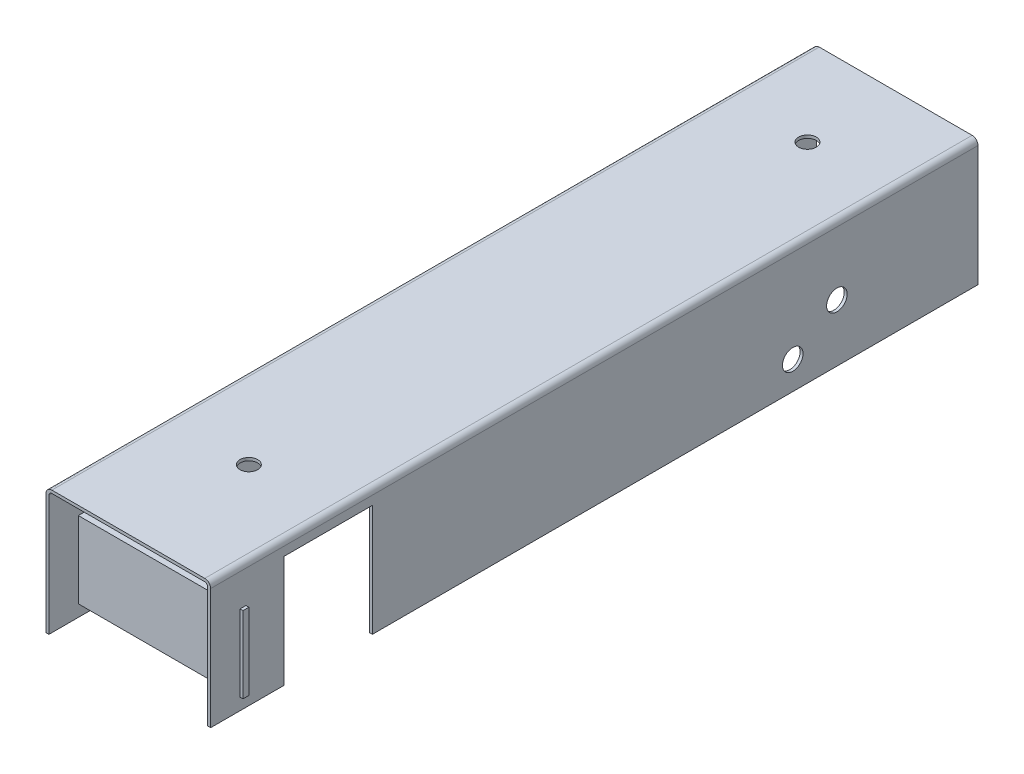
ISO-10303-21;
HEADER;
FILE_DESCRIPTION(('STEP AP214'),'2;1');
FILE_NAME('part.step','',(''),(''),'','','');
FILE_SCHEMA(('AUTOMOTIVE_DESIGN { 1 0 10303 214 1 1 1 1 }'));
ENDSEC;
DATA;
#1=APPLICATION_CONTEXT('core data for automotive mechanical design processes');
#2=APPLICATION_PROTOCOL_DEFINITION('international standard','automotive_design',2000,#1);
#3=PRODUCT_CONTEXT('',#1,'mechanical');
#4=PRODUCT('Part','Part','',(#3));
#5=PRODUCT_RELATED_PRODUCT_CATEGORY('part','',(#4));
#6=PRODUCT_DEFINITION_FORMATION('','',#4);
#7=PRODUCT_DEFINITION_CONTEXT('part definition',#1,'design');
#8=PRODUCT_DEFINITION('design','',#6,#7);
#9=PRODUCT_DEFINITION_SHAPE('','',#8);
#10=(LENGTH_UNIT() NAMED_UNIT(*) SI_UNIT(.MILLI.,.METRE.));
#11=(NAMED_UNIT(*) PLANE_ANGLE_UNIT() SI_UNIT($,.RADIAN.));
#12=(NAMED_UNIT(*) SI_UNIT($,.STERADIAN.) SOLID_ANGLE_UNIT());
#13=UNCERTAINTY_MEASURE_WITH_UNIT(LENGTH_MEASURE(1.E-05),#10,'distance_accuracy_value','');
#14=(GEOMETRIC_REPRESENTATION_CONTEXT(3) GLOBAL_UNCERTAINTY_ASSIGNED_CONTEXT((#13)) GLOBAL_UNIT_ASSIGNED_CONTEXT((#10,
#11,#12)) REPRESENTATION_CONTEXT('',''));
#15=CARTESIAN_POINT('',(0.,0.,0.));
#16=DIRECTION('',(0.,0.,1.));
#17=DIRECTION('',(1.,0.,0.));
#18=AXIS2_PLACEMENT_3D('',#15,#16,#17);
#19=CARTESIAN_POINT('',(0.,-21.5,261.));
#20=DIRECTION('',(0.,-1.,0.));
#21=DIRECTION('',(0.,0.,-1.));
#22=AXIS2_PLACEMENT_3D('',#19,#20,#21);
#23=PLANE('',#22);
#24=DIRECTION('',(-1.,0.,0.));
#25=VECTOR('',#24,1.);
#26=CARTESIAN_POINT('',(0.,-21.5,236.));
#27=LINE('',#26,#25);
#28=CARTESIAN_POINT('',(28.,-21.5,236.));
#29=VERTEX_POINT('',#28);
#30=CARTESIAN_POINT('',(27.,-21.5,236.));
#31=VERTEX_POINT('',#30);
#32=EDGE_CURVE('E269',#29,#31,#27,.T.);
#33=ORIENTED_EDGE('',*,*,#32,.F.);
#34=DIRECTION('',(0.,0.,-1.));
#35=VECTOR('',#34,1.);
#36=CARTESIAN_POINT('',(28.,-21.5,261.));
#37=LINE('',#36,#35);
#38=CARTESIAN_POINT('',(28.,-21.5,261.));
#39=VERTEX_POINT('',#38);
#40=EDGE_CURVE('E453',#39,#29,#37,.T.);
#41=ORIENTED_EDGE('',*,*,#40,.F.);
#42=DIRECTION('',(-1.,0.,0.));
#43=VECTOR('',#42,1.);
#44=CARTESIAN_POINT('',(0.,-21.5,261.));
#45=LINE('',#44,#43);
#46=CARTESIAN_POINT('',(27.,-21.5,261.));
#47=VERTEX_POINT('',#46);
#48=EDGE_CURVE('E390',#39,#47,#45,.T.);
#49=ORIENTED_EDGE('',*,*,#48,.T.);
#50=DIRECTION('',(0.,0.,-1.));
#51=VECTOR('',#50,1.);
#52=CARTESIAN_POINT('',(27.,-21.5,261.));
#53=LINE('',#52,#51);
#54=EDGE_CURVE('E457',#47,#31,#53,.T.);
#55=ORIENTED_EDGE('',*,*,#54,.T.);
#56=EDGE_LOOP('',(#33,#41,#49,#55));
#57=FACE_BOUND('',#56,.T.);
#58=ADVANCED_FACE('F46',(#57),#23,.T.);
#59=CARTESIAN_POINT('',(27.,0.,261.));
#60=DIRECTION('',(-1.,0.,0.));
#61=DIRECTION('',(0.,0.,1.));
#62=AXIS2_PLACEMENT_3D('',#59,#60,#61);
#63=PLANE('',#62);
#64=CARTESIAN_POINT('',(27.,-2.,48.));
#65=DIRECTION('',(-1.,0.,0.));
#66=DIRECTION('',(0.,0.,1.));
#67=AXIS2_PLACEMENT_3D('',#64,#65,#66);
#68=CIRCLE('',#67,3.5);
#69=CARTESIAN_POINT('',(27.,-2.,51.5));
#70=VERTEX_POINT('',#69);
#71=EDGE_CURVE('E256',#70,#70,#68,.T.);
#72=ORIENTED_EDGE('',*,*,#71,.F.);
#73=EDGE_LOOP('',(#72));
#74=FACE_BOUND('',#73,.T.);
#75=CARTESIAN_POINT('',(27.,-12.,63.));
#76=DIRECTION('',(-1.,0.,0.));
#77=DIRECTION('',(0.,0.,1.));
#78=AXIS2_PLACEMENT_3D('',#75,#76,#77);
#79=CIRCLE('',#78,3.5);
#80=CARTESIAN_POINT('',(27.,-12.,66.5));
#81=VERTEX_POINT('',#80);
#82=EDGE_CURVE('E543',#81,#81,#79,.T.);
#83=ORIENTED_EDGE('',*,*,#82,.F.);
#84=EDGE_LOOP('',(#83));
#85=FACE_BOUND('',#84,.T.);
#86=DIRECTION('',(0.,1.,0.));
#87=VECTOR('',#86,1.);
#88=CARTESIAN_POINT('',(27.,0.,236.));
#89=LINE('',#88,#87);
#90=CARTESIAN_POINT('',(27.,16.5,236.));
#91=VERTEX_POINT('',#90);
#92=EDGE_CURVE('E272',#31,#91,#89,.T.);
#93=ORIENTED_EDGE('',*,*,#92,.F.);
#94=ORIENTED_EDGE('',*,*,#54,.F.);
#95=DIRECTION('',(0.,1.,0.));
#96=VECTOR('',#95,1.);
#97=CARTESIAN_POINT('',(27.,0.,261.));
#98=LINE('',#97,#96);
#99=CARTESIAN_POINT('',(27.,19.5,261.));
#100=VERTEX_POINT('',#99);
#101=EDGE_CURVE('E386',#47,#100,#98,.T.);
#102=ORIENTED_EDGE('',*,*,#101,.T.);
#103=DIRECTION('',(0.,0.,-1.));
#104=VECTOR('',#103,1.);
#105=CARTESIAN_POINT('',(27.,19.5,261.));
#106=LINE('',#105,#104);
#107=CARTESIAN_POINT('',(27.,19.5,0.));
#108=VERTEX_POINT('',#107);
#109=EDGE_CURVE('E487',#100,#108,#106,.T.);
#110=ORIENTED_EDGE('',*,*,#109,.T.);
#111=DIRECTION('',(0.,1.,0.));
#112=VECTOR('',#111,1.);
#113=CARTESIAN_POINT('',(27.,0.,0.));
#114=LINE('',#113,#112);
#115=CARTESIAN_POINT('',(27.,-21.5,0.));
#116=VERTEX_POINT('',#115);
#117=EDGE_CURVE('E385',#116,#108,#114,.T.);
#118=ORIENTED_EDGE('',*,*,#117,.F.);
#119=CARTESIAN_POINT('',(27.,-21.5,206.));
#120=VERTEX_POINT('',#119);
#121=EDGE_CURVE('E456',#120,#116,#53,.T.);
#122=ORIENTED_EDGE('',*,*,#121,.F.);
#123=DIRECTION('',(0.,-1.,0.));
#124=VECTOR('',#123,1.);
#125=CARTESIAN_POINT('',(27.,0.,206.));
#126=LINE('',#125,#124);
#127=CARTESIAN_POINT('',(27.,16.5,206.));
#128=VERTEX_POINT('',#127);
#129=EDGE_CURVE('E264',#128,#120,#126,.T.);
#130=ORIENTED_EDGE('',*,*,#129,.F.);
#131=DIRECTION('',(0.,0.,-1.));
#132=VECTOR('',#131,1.);
#133=CARTESIAN_POINT('',(27.,16.5,261.));
#134=LINE('',#133,#132);
#135=EDGE_CURVE('E241',#91,#128,#134,.T.);
#136=ORIENTED_EDGE('',*,*,#135,.F.);
#137=EDGE_LOOP('',(#93,#94,#102,#110,#118,#122,#130,#136));
#138=FACE_BOUND('',#137,.T.);
#139=DIRECTION('',(0.,1.,0.));
#140=VECTOR('',#139,1.);
#141=CARTESIAN_POINT('',(27.,0.,251.));
#142=LINE('',#141,#140);
#143=CARTESIAN_POINT('',(27.,-17.5,251.));
#144=VERTEX_POINT('',#143);
#145=CARTESIAN_POINT('',(27.,8.5,251.));
#146=VERTEX_POINT('',#145);
#147=EDGE_CURVE('E382',#144,#146,#142,.T.);
#148=ORIENTED_EDGE('',*,*,#147,.F.);
#149=DIRECTION('',(0.,0.,1.));
#150=VECTOR('',#149,1.);
#151=CARTESIAN_POINT('',(27.,-17.5,261.));
#152=LINE('',#151,#150);
#153=CARTESIAN_POINT('',(27.,-17.5,249.));
#154=VERTEX_POINT('',#153);
#155=EDGE_CURVE('E348',#154,#144,#152,.T.);
#156=ORIENTED_EDGE('',*,*,#155,.F.);
#157=DIRECTION('',(0.,-1.,0.));
#158=VECTOR('',#157,1.);
#159=CARTESIAN_POINT('',(27.,0.,249.));
#160=LINE('',#159,#158);
#161=CARTESIAN_POINT('',(27.,8.5,249.));
#162=VERTEX_POINT('',#161);
#163=EDGE_CURVE('E360',#162,#154,#160,.T.);
#164=ORIENTED_EDGE('',*,*,#163,.F.);
#165=DIRECTION('',(0.,0.,-1.));
#166=VECTOR('',#165,1.);
#167=CARTESIAN_POINT('',(27.,8.5,261.));
#168=LINE('',#167,#166);
#169=EDGE_CURVE('E71',#146,#162,#168,.T.);
#170=ORIENTED_EDGE('',*,*,#169,.F.);
#171=EDGE_LOOP('',(#148,#156,#164,#170));
#172=FACE_BOUND('',#171,.T.);
#173=ADVANCED_FACE('F566',(#74,#85,#138,#172),#63,.T.);
#174=DIRECTION('',(1.,0.,0.));
#175=VECTOR('',#174,1.);
#176=CARTESIAN_POINT('',(0.,-21.5,206.));
#177=LINE('',#176,#175);
#178=CARTESIAN_POINT('',(28.,-21.5,206.));
#179=VERTEX_POINT('',#178);
#180=EDGE_CURVE('E63',#120,#179,#177,.T.);
#181=ORIENTED_EDGE('',*,*,#180,.F.);
#182=ORIENTED_EDGE('',*,*,#121,.T.);
#183=DIRECTION('',(-1.,0.,0.));
#184=VECTOR('',#183,1.);
#185=CARTESIAN_POINT('',(0.,-21.5,0.));
#186=LINE('',#185,#184);
#187=CARTESIAN_POINT('',(28.,-21.5,0.));
#188=VERTEX_POINT('',#187);
#189=EDGE_CURVE('E420',#188,#116,#186,.T.);
#190=ORIENTED_EDGE('',*,*,#189,.F.);
#191=EDGE_CURVE('E452',#179,#188,#37,.T.);
#192=ORIENTED_EDGE('',*,*,#191,.F.);
#193=EDGE_LOOP('',(#181,#182,#190,#192));
#194=FACE_BOUND('',#193,.T.);
#195=ADVANCED_FACE('F569',(#194),#23,.T.);
#196=CARTESIAN_POINT('',(28.,0.,261.));
#197=DIRECTION('',(1.,0.,0.));
#198=DIRECTION('',(0.,1.,0.));
#199=AXIS2_PLACEMENT_3D('',#196,#197,#198);
#200=PLANE('',#199);
#201=CARTESIAN_POINT('',(28.,-2.,48.));
#202=DIRECTION('',(1.,0.,0.));
#203=DIRECTION('',(0.,1.,0.));
#204=AXIS2_PLACEMENT_3D('',#201,#202,#203);
#205=CIRCLE('',#204,3.5);
#206=CARTESIAN_POINT('',(28.,1.5,48.));
#207=VERTEX_POINT('',#206);
#208=EDGE_CURVE('E537',#207,#207,#205,.T.);
#209=ORIENTED_EDGE('',*,*,#208,.F.);
#210=EDGE_LOOP('',(#209));
#211=FACE_BOUND('',#210,.T.);
#212=CARTESIAN_POINT('',(28.,-12.,63.));
#213=DIRECTION('',(1.,0.,0.));
#214=DIRECTION('',(0.,1.,0.));
#215=AXIS2_PLACEMENT_3D('',#212,#213,#214);
#216=CIRCLE('',#215,3.5);
#217=CARTESIAN_POINT('',(28.,-8.5,63.));
#218=VERTEX_POINT('',#217);
#219=EDGE_CURVE('E546',#218,#218,#216,.T.);
#220=ORIENTED_EDGE('',*,*,#219,.F.);
#221=EDGE_LOOP('',(#220));
#222=FACE_BOUND('',#221,.T.);
#223=DIRECTION('',(0.,-1.,0.));
#224=VECTOR('',#223,1.);
#225=CARTESIAN_POINT('',(28.,16.5,236.));
#226=LINE('',#225,#224);
#227=CARTESIAN_POINT('',(28.,16.5,236.));
#228=VERTEX_POINT('',#227);
#229=EDGE_CURVE('E252',#228,#29,#226,.T.);
#230=ORIENTED_EDGE('',*,*,#229,.F.);
#231=DIRECTION('',(0.,0.,1.));
#232=VECTOR('',#231,1.);
#233=CARTESIAN_POINT('',(28.,16.5,236.));
#234=LINE('',#233,#232);
#235=CARTESIAN_POINT('',(28.,16.5,206.));
#236=VERTEX_POINT('',#235);
#237=EDGE_CURVE('E238',#236,#228,#234,.T.);
#238=ORIENTED_EDGE('',*,*,#237,.F.);
#239=DIRECTION('',(0.,1.,0.));
#240=VECTOR('',#239,1.);
#241=CARTESIAN_POINT('',(28.,0.,206.));
#242=LINE('',#241,#240);
#243=EDGE_CURVE('E11',#179,#236,#242,.T.);
#244=ORIENTED_EDGE('',*,*,#243,.F.);
#245=ORIENTED_EDGE('',*,*,#191,.T.);
#246=DIRECTION('',(0.,-1.,0.));
#247=VECTOR('',#246,1.);
#248=CARTESIAN_POINT('',(28.,0.,0.));
#249=LINE('',#248,#247);
#250=CARTESIAN_POINT('',(28.,19.5,0.));
#251=VERTEX_POINT('',#250);
#252=EDGE_CURVE('E424',#251,#188,#249,.T.);
#253=ORIENTED_EDGE('',*,*,#252,.F.);
#254=DIRECTION('',(0.,0.,-1.));
#255=VECTOR('',#254,1.);
#256=CARTESIAN_POINT('',(28.,19.5,261.));
#257=LINE('',#256,#255);
#258=CARTESIAN_POINT('',(28.,19.5,261.));
#259=VERTEX_POINT('',#258);
#260=EDGE_CURVE('E484',#251,#259,#257,.F.);
#261=ORIENTED_EDGE('',*,*,#260,.T.);
#262=DIRECTION('',(0.,-1.,0.));
#263=VECTOR('',#262,1.);
#264=CARTESIAN_POINT('',(28.,0.,261.));
#265=LINE('',#264,#263);
#266=EDGE_CURVE('E395',#259,#39,#265,.T.);
#267=ORIENTED_EDGE('',*,*,#266,.T.);
#268=ORIENTED_EDGE('',*,*,#40,.T.);
#269=EDGE_LOOP('',(#230,#238,#244,#245,#253,#261,#267,#268));
#270=FACE_BOUND('',#269,.T.);
#271=DIRECTION('',(0.,-1.,0.));
#272=VECTOR('',#271,1.);
#273=CARTESIAN_POINT('',(28.,0.,251.));
#274=LINE('',#273,#272);
#275=CARTESIAN_POINT('',(28.,8.5,251.));
#276=VERTEX_POINT('',#275);
#277=CARTESIAN_POINT('',(28.,-17.5,251.));
#278=VERTEX_POINT('',#277);
#279=EDGE_CURVE('E378',#276,#278,#274,.T.);
#280=ORIENTED_EDGE('',*,*,#279,.F.);
#281=DIRECTION('',(0.,0.,1.));
#282=VECTOR('',#281,1.);
#283=CARTESIAN_POINT('',(28.,8.5,261.));
#284=LINE('',#283,#282);
#285=CARTESIAN_POINT('',(28.,8.5,249.));
#286=VERTEX_POINT('',#285);
#287=EDGE_CURVE('E368',#286,#276,#284,.T.);
#288=ORIENTED_EDGE('',*,*,#287,.F.);
#289=DIRECTION('',(0.,1.,0.));
#290=VECTOR('',#289,1.);
#291=CARTESIAN_POINT('',(28.,0.,249.));
#292=LINE('',#291,#290);
#293=CARTESIAN_POINT('',(28.,-17.5,249.));
#294=VERTEX_POINT('',#293);
#295=EDGE_CURVE('E356',#294,#286,#292,.T.);
#296=ORIENTED_EDGE('',*,*,#295,.F.);
#297=DIRECTION('',(0.,0.,-1.));
#298=VECTOR('',#297,1.);
#299=CARTESIAN_POINT('',(28.,-17.5,261.));
#300=LINE('',#299,#298);
#301=EDGE_CURVE('E344',#278,#294,#300,.T.);
#302=ORIENTED_EDGE('',*,*,#301,.F.);
#303=EDGE_LOOP('',(#280,#288,#296,#302));
#304=FACE_BOUND('',#303,.T.);
#305=ADVANCED_FACE('F249',(#211,#222,#270,#304),#200,.T.);
#306=CARTESIAN_POINT('',(0.,21.5,261.));
#307=DIRECTION('',(0.,1.,0.));
#308=DIRECTION('',(0.,0.,1.));
#309=AXIS2_PLACEMENT_3D('',#306,#307,#308);
#310=PLANE('',#309);
#311=CARTESIAN_POINT('',(0.,21.5,30.));
#312=DIRECTION('',(0.,1.,0.));
#313=DIRECTION('',(0.,0.,1.));
#314=AXIS2_PLACEMENT_3D('',#311,#312,#313);
#315=CIRCLE('',#314,3.);
#316=CARTESIAN_POINT('',(0.,21.5,33.));
#317=VERTEX_POINT('',#316);
#318=EDGE_CURVE('E276',#317,#317,#315,.T.);
#319=ORIENTED_EDGE('',*,*,#318,.F.);
#320=EDGE_LOOP('',(#319));
#321=FACE_BOUND('',#320,.T.);
#322=CARTESIAN_POINT('',(0.,21.5,220.));
#323=DIRECTION('',(0.,1.,0.));
#324=DIRECTION('',(0.,0.,1.));
#325=AXIS2_PLACEMENT_3D('',#322,#323,#324);
#326=CIRCLE('',#325,3.);
#327=CARTESIAN_POINT('',(0.,21.5,223.));
#328=VERTEX_POINT('',#327);
#329=EDGE_CURVE('E275',#328,#328,#326,.T.);
#330=ORIENTED_EDGE('',*,*,#329,.F.);
#331=EDGE_LOOP('',(#330));
#332=FACE_BOUND('',#331,.T.);
#333=DIRECTION('',(1.,0.,0.));
#334=VECTOR('',#333,1.);
#335=CARTESIAN_POINT('',(0.,21.5,0.));
#336=LINE('',#335,#334);
#337=CARTESIAN_POINT('',(-26.,21.5,0.));
#338=VERTEX_POINT('',#337);
#339=CARTESIAN_POINT('',(26.,21.5,0.));
#340=VERTEX_POINT('',#339);
#341=EDGE_CURVE('E428',#338,#340,#336,.T.);
#342=ORIENTED_EDGE('',*,*,#341,.F.);
#343=DIRECTION('',(0.,0.,-1.));
#344=VECTOR('',#343,1.);
#345=CARTESIAN_POINT('',(-26.,21.5,261.));
#346=LINE('',#345,#344);
#347=CARTESIAN_POINT('',(-26.,21.5,261.));
#348=VERTEX_POINT('',#347);
#349=EDGE_CURVE('E475',#338,#348,#346,.F.);
#350=ORIENTED_EDGE('',*,*,#349,.T.);
#351=DIRECTION('',(1.,0.,0.));
#352=VECTOR('',#351,1.);
#353=CARTESIAN_POINT('',(0.,21.5,261.));
#354=LINE('',#353,#352);
#355=CARTESIAN_POINT('',(26.,21.5,261.));
#356=VERTEX_POINT('',#355);
#357=EDGE_CURVE('E398',#348,#356,#354,.T.);
#358=ORIENTED_EDGE('',*,*,#357,.T.);
#359=DIRECTION('',(0.,0.,-1.));
#360=VECTOR('',#359,1.);
#361=CARTESIAN_POINT('',(26.,21.5,261.));
#362=LINE('',#361,#360);
#363=EDGE_CURVE('E471',#356,#340,#362,.T.);
#364=ORIENTED_EDGE('',*,*,#363,.T.);
#365=EDGE_LOOP('',(#342,#350,#358,#364));
#366=FACE_BOUND('',#365,.T.);
#367=ADVANCED_FACE('F620',(#321,#332,#366),#310,.T.);
#368=CARTESIAN_POINT('',(-28.,0.,261.));
#369=DIRECTION('',(1.,0.,0.));
#370=DIRECTION('',(0.,1.,0.));
#371=AXIS2_PLACEMENT_3D('',#368,#369,#370);
#372=PLANE('',#371);
#373=CARTESIAN_POINT('',(-28.,-2.,48.));
#374=DIRECTION('',(1.,0.,0.));
#375=DIRECTION('',(0.,1.,0.));
#376=AXIS2_PLACEMENT_3D('',#373,#374,#375);
#377=CIRCLE('',#376,3.5);
#378=CARTESIAN_POINT('',(-28.,1.5,48.));
#379=VERTEX_POINT('',#378);
#380=EDGE_CURVE('E557',#379,#379,#377,.T.);
#381=ORIENTED_EDGE('',*,*,#380,.T.);
#382=EDGE_LOOP('',(#381));
#383=FACE_BOUND('',#382,.T.);
#384=CARTESIAN_POINT('',(-28.,-12.,63.));
#385=DIRECTION('',(1.,0.,0.));
#386=DIRECTION('',(0.,1.,0.));
#387=AXIS2_PLACEMENT_3D('',#384,#385,#386);
#388=CIRCLE('',#387,3.5);
#389=CARTESIAN_POINT('',(-28.,-8.50000000000001,63.));
#390=VERTEX_POINT('',#389);
#391=EDGE_CURVE('E536',#390,#390,#388,.T.);
#392=ORIENTED_EDGE('',*,*,#391,.T.);
#393=EDGE_LOOP('',(#392));
#394=FACE_BOUND('',#393,.T.);
#395=DIRECTION('',(0.,0.,1.));
#396=VECTOR('',#395,1.);
#397=CARTESIAN_POINT('',(-28.,8.5,261.));
#398=LINE('',#397,#396);
#399=CARTESIAN_POINT('',(-28.,8.5,249.));
#400=VERTEX_POINT('',#399);
#401=CARTESIAN_POINT('',(-28.,8.5,251.));
#402=VERTEX_POINT('',#401);
#403=EDGE_CURVE('E364',#400,#402,#398,.T.);
#404=ORIENTED_EDGE('',*,*,#403,.T.);
#405=DIRECTION('',(0.,-1.,0.));
#406=VECTOR('',#405,1.);
#407=CARTESIAN_POINT('',(-28.,0.,251.));
#408=LINE('',#407,#406);
#409=CARTESIAN_POINT('',(-28.,-17.5,251.));
#410=VERTEX_POINT('',#409);
#411=EDGE_CURVE('E374',#402,#410,#408,.T.);
#412=ORIENTED_EDGE('',*,*,#411,.T.);
#413=DIRECTION('',(0.,0.,-1.));
#414=VECTOR('',#413,1.);
#415=CARTESIAN_POINT('',(-28.,-17.5,261.));
#416=LINE('',#415,#414);
#417=CARTESIAN_POINT('',(-28.,-17.5,249.));
#418=VERTEX_POINT('',#417);
#419=EDGE_CURVE('E322',#410,#418,#416,.T.);
#420=ORIENTED_EDGE('',*,*,#419,.T.);
#421=DIRECTION('',(0.,1.,0.));
#422=VECTOR('',#421,1.);
#423=CARTESIAN_POINT('',(-28.,0.,249.));
#424=LINE('',#423,#422);
#425=EDGE_CURVE('E352',#418,#400,#424,.T.);
#426=ORIENTED_EDGE('',*,*,#425,.T.);
#427=EDGE_LOOP('',(#404,#412,#420,#426));
#428=FACE_BOUND('',#427,.T.);
#429=DIRECTION('',(0.,-1.,0.));
#430=VECTOR('',#429,1.);
#431=CARTESIAN_POINT('',(-28.,0.,261.));
#432=LINE('',#431,#430);
#433=CARTESIAN_POINT('',(-28.,19.5,261.));
#434=VERTEX_POINT('',#433);
#435=CARTESIAN_POINT('',(-28.,-21.5,261.));
#436=VERTEX_POINT('',#435);
#437=EDGE_CURVE('E402',#434,#436,#432,.T.);
#438=ORIENTED_EDGE('',*,*,#437,.F.);
#439=DIRECTION('',(0.,0.,-1.));
#440=VECTOR('',#439,1.);
#441=CARTESIAN_POINT('',(-28.,19.5,0.));
#442=LINE('',#441,#440);
#443=CARTESIAN_POINT('',(-28.,19.5,0.));
#444=VERTEX_POINT('',#443);
#445=EDGE_CURVE('E461',#434,#444,#442,.T.);
#446=ORIENTED_EDGE('',*,*,#445,.T.);
#447=DIRECTION('',(0.,-1.,0.));
#448=VECTOR('',#447,1.);
#449=CARTESIAN_POINT('',(-28.,0.,0.));
#450=LINE('',#449,#448);
#451=CARTESIAN_POINT('',(-28.,-21.5,0.));
#452=VERTEX_POINT('',#451);
#453=EDGE_CURVE('E432',#444,#452,#450,.T.);
#454=ORIENTED_EDGE('',*,*,#453,.T.);
#455=DIRECTION('',(0.,0.,-1.));
#456=VECTOR('',#455,1.);
#457=CARTESIAN_POINT('',(-28.,-21.5,261.));
#458=LINE('',#457,#456);
#459=EDGE_CURVE('E448',#436,#452,#458,.T.);
#460=ORIENTED_EDGE('',*,*,#459,.F.);
#461=EDGE_LOOP('',(#438,#446,#454,#460));
#462=FACE_BOUND('',#461,.T.);
#463=ADVANCED_FACE('F627',(#383,#394,#428,#462),#372,.F.);
#464=CARTESIAN_POINT('',(0.,-21.5,261.));
#465=DIRECTION('',(0.,1.,0.));
#466=DIRECTION('',(0.,0.,1.));
#467=AXIS2_PLACEMENT_3D('',#464,#465,#466);
#468=PLANE('',#467);
#469=DIRECTION('',(1.,0.,0.));
#470=VECTOR('',#469,1.);
#471=CARTESIAN_POINT('',(0.,-21.5,0.));
#472=LINE('',#471,#470);
#473=CARTESIAN_POINT('',(-27.,-21.5,0.));
#474=VERTEX_POINT('',#473);
#475=EDGE_CURVE('E435',#452,#474,#472,.T.);
#476=ORIENTED_EDGE('',*,*,#475,.T.);
#477=DIRECTION('',(0.,0.,-1.));
#478=VECTOR('',#477,1.);
#479=CARTESIAN_POINT('',(-27.,-21.5,261.));
#480=LINE('',#479,#478);
#481=CARTESIAN_POINT('',(-27.,-21.5,261.));
#482=VERTEX_POINT('',#481);
#483=EDGE_CURVE('E416',#482,#474,#480,.T.);
#484=ORIENTED_EDGE('',*,*,#483,.F.);
#485=DIRECTION('',(1.,0.,0.));
#486=VECTOR('',#485,1.);
#487=CARTESIAN_POINT('',(0.,-21.5,261.));
#488=LINE('',#487,#486);
#489=EDGE_CURVE('E405',#436,#482,#488,.T.);
#490=ORIENTED_EDGE('',*,*,#489,.F.);
#491=ORIENTED_EDGE('',*,*,#459,.T.);
#492=EDGE_LOOP('',(#476,#484,#490,#491));
#493=FACE_BOUND('',#492,.T.);
#494=ADVANCED_FACE('F689',(#493),#468,.F.);
#495=CARTESIAN_POINT('',(-27.,0.,261.));
#496=DIRECTION('',(-1.,0.,0.));
#497=DIRECTION('',(0.,0.,1.));
#498=AXIS2_PLACEMENT_3D('',#495,#496,#497);
#499=PLANE('',#498);
#500=CARTESIAN_POINT('',(-27.,-2.,48.));
#501=DIRECTION('',(-1.,0.,0.));
#502=DIRECTION('',(0.,0.,1.));
#503=AXIS2_PLACEMENT_3D('',#500,#501,#502);
#504=CIRCLE('',#503,3.5);
#505=CARTESIAN_POINT('',(-27.,-2.,51.5));
#506=VERTEX_POINT('',#505);
#507=EDGE_CURVE('E50',#506,#506,#504,.T.);
#508=ORIENTED_EDGE('',*,*,#507,.T.);
#509=EDGE_LOOP('',(#508));
#510=FACE_BOUND('',#509,.T.);
#511=CARTESIAN_POINT('',(-27.,-12.,63.));
#512=DIRECTION('',(-1.,0.,0.));
#513=DIRECTION('',(0.,0.,1.));
#514=AXIS2_PLACEMENT_3D('',#511,#512,#513);
#515=CIRCLE('',#514,3.5);
#516=CARTESIAN_POINT('',(-27.,-12.,66.5));
#517=VERTEX_POINT('',#516);
#518=EDGE_CURVE('E533',#517,#517,#515,.T.);
#519=ORIENTED_EDGE('',*,*,#518,.T.);
#520=EDGE_LOOP('',(#519));
#521=FACE_BOUND('',#520,.T.);
#522=DIRECTION('',(0.,0.,1.));
#523=VECTOR('',#522,1.);
#524=CARTESIAN_POINT('',(-27.,-17.5,261.));
#525=LINE('',#524,#523);
#526=CARTESIAN_POINT('',(-27.,-17.5,249.));
#527=VERTEX_POINT('',#526);
#528=CARTESIAN_POINT('',(-27.,-17.5,251.));
#529=VERTEX_POINT('',#528);
#530=EDGE_CURVE('E513',#527,#529,#525,.T.);
#531=ORIENTED_EDGE('',*,*,#530,.T.);
#532=DIRECTION('',(0.,1.,0.));
#533=VECTOR('',#532,1.);
#534=CARTESIAN_POINT('',(-27.,0.,251.));
#535=LINE('',#534,#533);
#536=CARTESIAN_POINT('',(-27.,8.5,251.));
#537=VERTEX_POINT('',#536);
#538=EDGE_CURVE('E56',#529,#537,#535,.T.);
#539=ORIENTED_EDGE('',*,*,#538,.T.);
#540=DIRECTION('',(0.,0.,-1.));
#541=VECTOR('',#540,1.);
#542=CARTESIAN_POINT('',(-27.,8.5,261.));
#543=LINE('',#542,#541);
#544=CARTESIAN_POINT('',(-27.,8.5,249.));
#545=VERTEX_POINT('',#544);
#546=EDGE_CURVE('E521',#537,#545,#543,.T.);
#547=ORIENTED_EDGE('',*,*,#546,.T.);
#548=DIRECTION('',(0.,-1.,0.));
#549=VECTOR('',#548,1.);
#550=CARTESIAN_POINT('',(-27.,0.,249.));
#551=LINE('',#550,#549);
#552=EDGE_CURVE('E517',#545,#527,#551,.T.);
#553=ORIENTED_EDGE('',*,*,#552,.T.);
#554=EDGE_LOOP('',(#531,#539,#547,#553));
#555=FACE_BOUND('',#554,.T.);
#556=DIRECTION('',(0.,1.,0.));
#557=VECTOR('',#556,1.);
#558=CARTESIAN_POINT('',(-27.,0.,0.));
#559=LINE('',#558,#557);
#560=CARTESIAN_POINT('',(-27.,19.5,0.));
#561=VERTEX_POINT('',#560);
#562=EDGE_CURVE('E438',#474,#561,#559,.T.);
#563=ORIENTED_EDGE('',*,*,#562,.T.);
#564=DIRECTION('',(0.,0.,-1.));
#565=VECTOR('',#564,1.);
#566=CARTESIAN_POINT('',(-27.,19.5,261.));
#567=LINE('',#566,#565);
#568=CARTESIAN_POINT('',(-27.,19.5,261.));
#569=VERTEX_POINT('',#568);
#570=EDGE_CURVE('E498',#561,#569,#567,.F.);
#571=ORIENTED_EDGE('',*,*,#570,.T.);
#572=DIRECTION('',(0.,1.,0.));
#573=VECTOR('',#572,1.);
#574=CARTESIAN_POINT('',(-27.,0.,261.));
#575=LINE('',#574,#573);
#576=EDGE_CURVE('E408',#482,#569,#575,.T.);
#577=ORIENTED_EDGE('',*,*,#576,.F.);
#578=ORIENTED_EDGE('',*,*,#483,.T.);
#579=EDGE_LOOP('',(#563,#571,#577,#578));
#580=FACE_BOUND('',#579,.T.);
#581=ADVANCED_FACE('F609',(#510,#521,#555,#580),#499,.F.);
#582=CARTESIAN_POINT('',(0.,20.5,261.));
#583=DIRECTION('',(0.,1.,0.));
#584=DIRECTION('',(0.,0.,1.));
#585=AXIS2_PLACEMENT_3D('',#582,#583,#584);
#586=PLANE('',#585);
#587=CARTESIAN_POINT('',(0.,20.5,30.));
#588=DIRECTION('',(0.,1.,0.));
#589=DIRECTION('',(0.,0.,1.));
#590=AXIS2_PLACEMENT_3D('',#587,#588,#589);
#591=CIRCLE('',#590,3.);
#592=CARTESIAN_POINT('',(0.,20.5,33.));
#593=VERTEX_POINT('',#592);
#594=EDGE_CURVE('E289',#593,#593,#591,.T.);
#595=ORIENTED_EDGE('',*,*,#594,.T.);
#596=EDGE_LOOP('',(#595));
#597=FACE_BOUND('',#596,.T.);
#598=CARTESIAN_POINT('',(0.,20.5,220.));
#599=DIRECTION('',(0.,1.,0.));
#600=DIRECTION('',(0.,0.,1.));
#601=AXIS2_PLACEMENT_3D('',#598,#599,#600);
#602=CIRCLE('',#601,3.);
#603=CARTESIAN_POINT('',(0.,20.5,223.));
#604=VERTEX_POINT('',#603);
#605=EDGE_CURVE('E280',#604,#604,#602,.T.);
#606=ORIENTED_EDGE('',*,*,#605,.T.);
#607=EDGE_LOOP('',(#606));
#608=FACE_BOUND('',#607,.T.);
#609=DIRECTION('',(1.,0.,0.));
#610=VECTOR('',#609,1.);
#611=CARTESIAN_POINT('',(0.,20.5,0.));
#612=LINE('',#611,#610);
#613=CARTESIAN_POINT('',(-26.,20.5,0.));
#614=VERTEX_POINT('',#613);
#615=CARTESIAN_POINT('',(26.,20.5,0.));
#616=VERTEX_POINT('',#615);
#617=EDGE_CURVE('E391',#614,#616,#612,.T.);
#618=ORIENTED_EDGE('',*,*,#617,.T.);
#619=DIRECTION('',(0.,0.,-1.));
#620=VECTOR('',#619,1.);
#621=CARTESIAN_POINT('',(26.,20.5,261.));
#622=LINE('',#621,#620);
#623=CARTESIAN_POINT('',(26.,20.5,261.));
#624=VERTEX_POINT('',#623);
#625=EDGE_CURVE('E495',#616,#624,#622,.F.);
#626=ORIENTED_EDGE('',*,*,#625,.T.);
#627=DIRECTION('',(1.,0.,0.));
#628=VECTOR('',#627,1.);
#629=CARTESIAN_POINT('',(0.,20.5,261.));
#630=LINE('',#629,#628);
#631=CARTESIAN_POINT('',(-26.,20.5,261.));
#632=VERTEX_POINT('',#631);
#633=EDGE_CURVE('E412',#632,#624,#630,.T.);
#634=ORIENTED_EDGE('',*,*,#633,.F.);
#635=DIRECTION('',(0.,0.,-1.));
#636=VECTOR('',#635,1.);
#637=CARTESIAN_POINT('',(-26.,20.5,0.));
#638=LINE('',#637,#636);
#639=EDGE_CURVE('E491',#632,#614,#638,.T.);
#640=ORIENTED_EDGE('',*,*,#639,.T.);
#641=EDGE_LOOP('',(#618,#626,#634,#640));
#642=FACE_BOUND('',#641,.T.);
#643=ADVANCED_FACE('F694',(#597,#608,#642),#586,.F.);
#644=CARTESIAN_POINT('',(0.,0.,261.));
#645=DIRECTION('',(0.,0.,1.));
#646=DIRECTION('',(1.,0.,0.));
#647=AXIS2_PLACEMENT_3D('',#644,#645,#646);
#648=PLANE('',#647);
#649=ORIENTED_EDGE('',*,*,#357,.F.);
#650=CARTESIAN_POINT('',(-26.,19.5,261.));
#651=DIRECTION('',(0.,0.,1.));
#652=DIRECTION('',(1.,0.,0.));
#653=AXIS2_PLACEMENT_3D('',#650,#651,#652);
#654=CIRCLE('',#653,2.);
#655=EDGE_CURVE('E481',#348,#434,#654,.T.);
#656=ORIENTED_EDGE('',*,*,#655,.T.);
#657=ORIENTED_EDGE('',*,*,#437,.T.);
#658=ORIENTED_EDGE('',*,*,#489,.T.);
#659=ORIENTED_EDGE('',*,*,#576,.T.);
#660=CARTESIAN_POINT('',(-26.,19.5,261.));
#661=DIRECTION('',(0.,0.,1.));
#662=DIRECTION('',(1.,0.,0.));
#663=AXIS2_PLACEMENT_3D('',#660,#661,#662);
#664=CIRCLE('',#663,1.);
#665=EDGE_CURVE('E510',#569,#632,#664,.F.);
#666=ORIENTED_EDGE('',*,*,#665,.T.);
#667=ORIENTED_EDGE('',*,*,#633,.T.);
#668=CARTESIAN_POINT('',(26.,19.5,261.));
#669=DIRECTION('',(0.,0.,1.));
#670=DIRECTION('',(1.,0.,0.));
#671=AXIS2_PLACEMENT_3D('',#668,#669,#670);
#672=CIRCLE('',#671,1.);
#673=EDGE_CURVE('E504',#624,#100,#672,.F.);
#674=ORIENTED_EDGE('',*,*,#673,.T.);
#675=ORIENTED_EDGE('',*,*,#101,.F.);
#676=ORIENTED_EDGE('',*,*,#48,.F.);
#677=ORIENTED_EDGE('',*,*,#266,.F.);
#678=CARTESIAN_POINT('',(26.,19.5,261.));
#679=DIRECTION('',(0.,0.,1.));
#680=DIRECTION('',(1.,0.,0.));
#681=AXIS2_PLACEMENT_3D('',#678,#679,#680);
#682=CIRCLE('',#681,2.);
#683=EDGE_CURVE('E478',#259,#356,#682,.T.);
#684=ORIENTED_EDGE('',*,*,#683,.T.);
#685=EDGE_LOOP('',(#649,#656,#657,#658,#659,#666,#667,#674,#675,#676,#677,#684));
#686=FACE_BOUND('',#685,.T.);
#687=ADVANCED_FACE('F663',(#686),#648,.T.);
#688=CARTESIAN_POINT('',(0.,0.,0.));
#689=DIRECTION('',(0.,0.,1.));
#690=DIRECTION('',(1.,0.,0.));
#691=AXIS2_PLACEMENT_3D('',#688,#689,#690);
#692=PLANE('',#691);
#693=ORIENTED_EDGE('',*,*,#453,.F.);
#694=CARTESIAN_POINT('',(-26.,19.5,0.));
#695=DIRECTION('',(0.,0.,1.));
#696=DIRECTION('',(1.,0.,0.));
#697=AXIS2_PLACEMENT_3D('',#694,#695,#696);
#698=CIRCLE('',#697,2.);
#699=EDGE_CURVE('E468',#444,#338,#698,.F.);
#700=ORIENTED_EDGE('',*,*,#699,.T.);
#701=ORIENTED_EDGE('',*,*,#341,.T.);
#702=CARTESIAN_POINT('',(26.,19.5,0.));
#703=DIRECTION('',(0.,0.,1.));
#704=DIRECTION('',(1.,0.,0.));
#705=AXIS2_PLACEMENT_3D('',#702,#703,#704);
#706=CIRCLE('',#705,2.);
#707=EDGE_CURVE('E465',#340,#251,#706,.F.);
#708=ORIENTED_EDGE('',*,*,#707,.T.);
#709=ORIENTED_EDGE('',*,*,#252,.T.);
#710=ORIENTED_EDGE('',*,*,#189,.T.);
#711=ORIENTED_EDGE('',*,*,#117,.T.);
#712=CARTESIAN_POINT('',(26.,19.5,0.));
#713=DIRECTION('',(0.,0.,1.));
#714=DIRECTION('',(1.,0.,0.));
#715=AXIS2_PLACEMENT_3D('',#712,#713,#714);
#716=CIRCLE('',#715,1.);
#717=EDGE_CURVE('E501',#108,#616,#716,.T.);
#718=ORIENTED_EDGE('',*,*,#717,.T.);
#719=ORIENTED_EDGE('',*,*,#617,.F.);
#720=CARTESIAN_POINT('',(-26.,19.5,0.));
#721=DIRECTION('',(0.,0.,1.));
#722=DIRECTION('',(1.,0.,0.));
#723=AXIS2_PLACEMENT_3D('',#720,#721,#722);
#724=CIRCLE('',#723,1.);
#725=EDGE_CURVE('E507',#614,#561,#724,.T.);
#726=ORIENTED_EDGE('',*,*,#725,.T.);
#727=ORIENTED_EDGE('',*,*,#562,.F.);
#728=ORIENTED_EDGE('',*,*,#475,.F.);
#729=EDGE_LOOP('',(#693,#700,#701,#708,#709,#710,#711,#718,#719,#726,#727,#728));
#730=FACE_BOUND('',#729,.T.);
#731=ADVANCED_FACE('F645',(#730),#692,.F.);
#732=CARTESIAN_POINT('',(-26.,19.5,261.));
#733=DIRECTION('',(0.,0.,1.));
#734=DIRECTION('',(1.,0.,0.));
#735=AXIS2_PLACEMENT_3D('',#732,#733,#734);
#736=CYLINDRICAL_SURFACE('',#735,2.);
#737=ORIENTED_EDGE('',*,*,#655,.F.);
#738=ORIENTED_EDGE('',*,*,#349,.F.);
#739=ORIENTED_EDGE('',*,*,#699,.F.);
#740=ORIENTED_EDGE('',*,*,#445,.F.);
#741=EDGE_LOOP('',(#737,#738,#739,#740));
#742=FACE_BOUND('',#741,.T.);
#743=ADVANCED_FACE('F641',(#742),#736,.T.);
#744=CARTESIAN_POINT('',(26.,19.5,261.));
#745=DIRECTION('',(0.,0.,-1.));
#746=DIRECTION('',(-1.,0.,0.));
#747=AXIS2_PLACEMENT_3D('',#744,#745,#746);
#748=CYLINDRICAL_SURFACE('',#747,2.);
#749=ORIENTED_EDGE('',*,*,#683,.F.);
#750=ORIENTED_EDGE('',*,*,#260,.F.);
#751=ORIENTED_EDGE('',*,*,#707,.F.);
#752=ORIENTED_EDGE('',*,*,#363,.F.);
#753=EDGE_LOOP('',(#749,#750,#751,#752));
#754=FACE_BOUND('',#753,.T.);
#755=ADVANCED_FACE('F644',(#754),#748,.T.);
#756=CARTESIAN_POINT('',(26.,19.5,261.));
#757=DIRECTION('',(0.,0.,-1.));
#758=DIRECTION('',(-1.,0.,0.));
#759=AXIS2_PLACEMENT_3D('',#756,#757,#758);
#760=CYLINDRICAL_SURFACE('',#759,1.);
#761=ORIENTED_EDGE('',*,*,#673,.F.);
#762=ORIENTED_EDGE('',*,*,#625,.F.);
#763=ORIENTED_EDGE('',*,*,#717,.F.);
#764=ORIENTED_EDGE('',*,*,#109,.F.);
#765=EDGE_LOOP('',(#761,#762,#763,#764));
#766=FACE_BOUND('',#765,.T.);
#767=ADVANCED_FACE('F648',(#766),#760,.F.);
#768=CARTESIAN_POINT('',(-26.,19.5,261.));
#769=DIRECTION('',(0.,0.,1.));
#770=DIRECTION('',(1.,0.,0.));
#771=AXIS2_PLACEMENT_3D('',#768,#769,#770);
#772=CYLINDRICAL_SURFACE('',#771,1.);
#773=ORIENTED_EDGE('',*,*,#665,.F.);
#774=ORIENTED_EDGE('',*,*,#570,.F.);
#775=ORIENTED_EDGE('',*,*,#725,.F.);
#776=ORIENTED_EDGE('',*,*,#639,.F.);
#777=EDGE_LOOP('',(#773,#774,#775,#776));
#778=FACE_BOUND('',#777,.T.);
#779=ADVANCED_FACE('F48',(#778),#772,.F.);
#780=CARTESIAN_POINT('',(-29.,-17.5,251.));
#781=DIRECTION('',(0.,-1.,0.));
#782=DIRECTION('',(0.,0.,-1.));
#783=AXIS2_PLACEMENT_3D('',#780,#781,#782);
#784=PLANE('',#783);
#785=DIRECTION('',(1.,0.,0.));
#786=VECTOR('',#785,1.);
#787=CARTESIAN_POINT('',(-29.,-17.5,249.));
#788=LINE('',#787,#786);
#789=EDGE_CURVE('E334',#527,#154,#788,.T.);
#790=ORIENTED_EDGE('',*,*,#789,.T.);
#791=ORIENTED_EDGE('',*,*,#155,.T.);
#792=DIRECTION('',(1.,0.,0.));
#793=VECTOR('',#792,1.);
#794=CARTESIAN_POINT('',(-29.,-17.5,251.));
#795=LINE('',#794,#793);
#796=EDGE_CURVE('E340',#529,#144,#795,.T.);
#797=ORIENTED_EDGE('',*,*,#796,.F.);
#798=ORIENTED_EDGE('',*,*,#530,.F.);
#799=EDGE_LOOP('',(#790,#791,#797,#798));
#800=FACE_BOUND('',#799,.T.);
#801=ADVANCED_FACE('F580',(#800),#784,.T.);
#802=CARTESIAN_POINT('',(-29.,-17.5,249.));
#803=DIRECTION('',(0.,0.,-1.));
#804=DIRECTION('',(-1.,0.,0.));
#805=AXIS2_PLACEMENT_3D('',#802,#803,#804);
#806=PLANE('',#805);
#807=DIRECTION('',(1.,0.,0.));
#808=VECTOR('',#807,1.);
#809=CARTESIAN_POINT('',(-29.,8.5,249.));
#810=LINE('',#809,#808);
#811=EDGE_CURVE('E329',#545,#162,#810,.T.);
#812=ORIENTED_EDGE('',*,*,#811,.T.);
#813=ORIENTED_EDGE('',*,*,#163,.T.);
#814=ORIENTED_EDGE('',*,*,#789,.F.);
#815=ORIENTED_EDGE('',*,*,#552,.F.);
#816=EDGE_LOOP('',(#812,#813,#814,#815));
#817=FACE_BOUND('',#816,.T.);
#818=ADVANCED_FACE('F612',(#817),#806,.T.);
#819=CARTESIAN_POINT('',(-29.,8.5,251.));
#820=DIRECTION('',(0.,1.,0.));
#821=DIRECTION('',(0.,0.,1.));
#822=AXIS2_PLACEMENT_3D('',#819,#820,#821);
#823=PLANE('',#822);
#824=DIRECTION('',(1.,0.,0.));
#825=VECTOR('',#824,1.);
#826=CARTESIAN_POINT('',(-29.,8.5,251.));
#827=LINE('',#826,#825);
#828=EDGE_CURVE('E323',#537,#146,#827,.T.);
#829=ORIENTED_EDGE('',*,*,#828,.T.);
#830=ORIENTED_EDGE('',*,*,#169,.T.);
#831=ORIENTED_EDGE('',*,*,#811,.F.);
#832=ORIENTED_EDGE('',*,*,#546,.F.);
#833=EDGE_LOOP('',(#829,#830,#831,#832));
#834=FACE_BOUND('',#833,.T.);
#835=ADVANCED_FACE('F605',(#834),#823,.T.);
#836=CARTESIAN_POINT('',(-29.,-17.5,251.));
#837=DIRECTION('',(0.,0.,1.));
#838=DIRECTION('',(1.,0.,0.));
#839=AXIS2_PLACEMENT_3D('',#836,#837,#838);
#840=PLANE('',#839);
#841=ORIENTED_EDGE('',*,*,#796,.T.);
#842=ORIENTED_EDGE('',*,*,#147,.T.);
#843=ORIENTED_EDGE('',*,*,#828,.F.);
#844=ORIENTED_EDGE('',*,*,#538,.F.);
#845=EDGE_LOOP('',(#841,#842,#843,#844));
#846=FACE_BOUND('',#845,.T.);
#847=ADVANCED_FACE('F583',(#846),#840,.T.);
#848=CARTESIAN_POINT('',(-29.,0.,0.));
#849=DIRECTION('',(-1.,0.,0.));
#850=DIRECTION('',(0.,0.,1.));
#851=AXIS2_PLACEMENT_3D('',#848,#849,#850);
#852=PLANE('',#851);
#853=DIRECTION('',(0.,-1.,0.));
#854=VECTOR('',#853,1.);
#855=CARTESIAN_POINT('',(-29.,-17.5,251.));
#856=LINE('',#855,#854);
#857=CARTESIAN_POINT('',(-29.,8.5,251.));
#858=VERTEX_POINT('',#857);
#859=CARTESIAN_POINT('',(-29.,-17.5,251.));
#860=VERTEX_POINT('',#859);
#861=EDGE_CURVE('E301',#858,#860,#856,.T.);
#862=ORIENTED_EDGE('',*,*,#861,.F.);
#863=DIRECTION('',(0.,0.,1.));
#864=VECTOR('',#863,1.);
#865=CARTESIAN_POINT('',(-29.,8.5,251.));
#866=LINE('',#865,#864);
#867=CARTESIAN_POINT('',(-29.,8.5,249.));
#868=VERTEX_POINT('',#867);
#869=EDGE_CURVE('E313',#868,#858,#866,.T.);
#870=ORIENTED_EDGE('',*,*,#869,.F.);
#871=DIRECTION('',(0.,1.,0.));
#872=VECTOR('',#871,1.);
#873=CARTESIAN_POINT('',(-29.,-17.5,249.));
#874=LINE('',#873,#872);
#875=CARTESIAN_POINT('',(-29.,-17.5,249.));
#876=VERTEX_POINT('',#875);
#877=EDGE_CURVE('E309',#876,#868,#874,.T.);
#878=ORIENTED_EDGE('',*,*,#877,.F.);
#879=DIRECTION('',(0.,0.,-1.));
#880=VECTOR('',#879,1.);
#881=CARTESIAN_POINT('',(-29.,-17.5,251.));
#882=LINE('',#881,#880);
#883=EDGE_CURVE('E305',#860,#876,#882,.T.);
#884=ORIENTED_EDGE('',*,*,#883,.F.);
#885=EDGE_LOOP('',(#862,#870,#878,#884));
#886=FACE_BOUND('',#885,.T.);
#887=ADVANCED_FACE('F733',(#886),#852,.T.);
#888=ORIENTED_EDGE('',*,*,#419,.F.);
#889=EDGE_CURVE('E336',#860,#410,#795,.T.);
#890=ORIENTED_EDGE('',*,*,#889,.F.);
#891=ORIENTED_EDGE('',*,*,#883,.T.);
#892=EDGE_CURVE('E331',#876,#418,#788,.T.);
#893=ORIENTED_EDGE('',*,*,#892,.T.);
#894=EDGE_LOOP('',(#888,#890,#891,#893));
#895=FACE_BOUND('',#894,.T.);
#896=ADVANCED_FACE('F737',(#895),#784,.T.);
#897=ORIENTED_EDGE('',*,*,#425,.F.);
#898=ORIENTED_EDGE('',*,*,#892,.F.);
#899=ORIENTED_EDGE('',*,*,#877,.T.);
#900=EDGE_CURVE('E325',#868,#400,#810,.T.);
#901=ORIENTED_EDGE('',*,*,#900,.T.);
#902=EDGE_LOOP('',(#897,#898,#899,#901));
#903=FACE_BOUND('',#902,.T.);
#904=ADVANCED_FACE('F727',(#903),#806,.T.);
#905=ORIENTED_EDGE('',*,*,#403,.F.);
#906=ORIENTED_EDGE('',*,*,#900,.F.);
#907=ORIENTED_EDGE('',*,*,#869,.T.);
#908=EDGE_CURVE('E318',#858,#402,#827,.T.);
#909=ORIENTED_EDGE('',*,*,#908,.T.);
#910=EDGE_LOOP('',(#905,#906,#907,#909));
#911=FACE_BOUND('',#910,.T.);
#912=ADVANCED_FACE('F725',(#911),#823,.T.);
#913=ORIENTED_EDGE('',*,*,#411,.F.);
#914=ORIENTED_EDGE('',*,*,#908,.F.);
#915=ORIENTED_EDGE('',*,*,#861,.T.);
#916=ORIENTED_EDGE('',*,*,#889,.T.);
#917=EDGE_LOOP('',(#913,#914,#915,#916));
#918=FACE_BOUND('',#917,.T.);
#919=ADVANCED_FACE('F735',(#918),#840,.T.);
#920=CARTESIAN_POINT('',(29.,8.5,251.));
#921=VERTEX_POINT('',#920);
#922=EDGE_CURVE('E324',#276,#921,#827,.T.);
#923=ORIENTED_EDGE('',*,*,#922,.F.);
#924=ORIENTED_EDGE('',*,*,#279,.T.);
#925=CARTESIAN_POINT('',(29.,-17.5,251.));
#926=VERTEX_POINT('',#925);
#927=EDGE_CURVE('E317',#278,#926,#795,.T.);
#928=ORIENTED_EDGE('',*,*,#927,.T.);
#929=DIRECTION('',(0.,-1.,0.));
#930=VECTOR('',#929,1.);
#931=CARTESIAN_POINT('',(29.,-17.5,251.));
#932=LINE('',#931,#930);
#933=EDGE_CURVE('E284',#921,#926,#932,.T.);
#934=ORIENTED_EDGE('',*,*,#933,.F.);
#935=EDGE_LOOP('',(#923,#924,#928,#934));
#936=FACE_BOUND('',#935,.T.);
#937=ADVANCED_FACE('F591',(#936),#840,.T.);
#938=CARTESIAN_POINT('',(29.,8.5,249.));
#939=VERTEX_POINT('',#938);
#940=EDGE_CURVE('E330',#286,#939,#810,.T.);
#941=ORIENTED_EDGE('',*,*,#940,.F.);
#942=ORIENTED_EDGE('',*,*,#287,.T.);
#943=ORIENTED_EDGE('',*,*,#922,.T.);
#944=DIRECTION('',(0.,0.,1.));
#945=VECTOR('',#944,1.);
#946=CARTESIAN_POINT('',(29.,8.5,251.));
#947=LINE('',#946,#945);
#948=EDGE_CURVE('E297',#939,#921,#947,.T.);
#949=ORIENTED_EDGE('',*,*,#948,.F.);
#950=EDGE_LOOP('',(#941,#942,#943,#949));
#951=FACE_BOUND('',#950,.T.);
#952=ADVANCED_FACE('F601',(#951),#823,.T.);
#953=CARTESIAN_POINT('',(29.,-17.5,249.));
#954=VERTEX_POINT('',#953);
#955=EDGE_CURVE('E335',#294,#954,#788,.T.);
#956=ORIENTED_EDGE('',*,*,#955,.F.);
#957=ORIENTED_EDGE('',*,*,#295,.T.);
#958=ORIENTED_EDGE('',*,*,#940,.T.);
#959=DIRECTION('',(0.,1.,0.));
#960=VECTOR('',#959,1.);
#961=CARTESIAN_POINT('',(29.,-17.5,249.));
#962=LINE('',#961,#960);
#963=EDGE_CURVE('E293',#954,#939,#962,.T.);
#964=ORIENTED_EDGE('',*,*,#963,.F.);
#965=EDGE_LOOP('',(#956,#957,#958,#964));
#966=FACE_BOUND('',#965,.T.);
#967=ADVANCED_FACE('F618',(#966),#806,.T.);
#968=ORIENTED_EDGE('',*,*,#927,.F.);
#969=ORIENTED_EDGE('',*,*,#301,.T.);
#970=ORIENTED_EDGE('',*,*,#955,.T.);
#971=DIRECTION('',(0.,0.,-1.));
#972=VECTOR('',#971,1.);
#973=CARTESIAN_POINT('',(29.,-17.5,251.));
#974=LINE('',#973,#972);
#975=EDGE_CURVE('E288',#926,#954,#974,.T.);
#976=ORIENTED_EDGE('',*,*,#975,.F.);
#977=EDGE_LOOP('',(#968,#969,#970,#976));
#978=FACE_BOUND('',#977,.T.);
#979=ADVANCED_FACE('F593',(#978),#784,.T.);
#980=CARTESIAN_POINT('',(29.,0.,0.));
#981=DIRECTION('',(-1.,0.,0.));
#982=DIRECTION('',(0.,0.,1.));
#983=AXIS2_PLACEMENT_3D('',#980,#981,#982);
#984=PLANE('',#983);
#985=ORIENTED_EDGE('',*,*,#933,.T.);
#986=ORIENTED_EDGE('',*,*,#975,.T.);
#987=ORIENTED_EDGE('',*,*,#963,.T.);
#988=ORIENTED_EDGE('',*,*,#948,.T.);
#989=EDGE_LOOP('',(#985,#986,#987,#988));
#990=FACE_BOUND('',#989,.T.);
#991=ADVANCED_FACE('F597',(#990),#984,.F.);
#992=CARTESIAN_POINT('',(0.,10.5,220.));
#993=DIRECTION('',(0.,1.,0.));
#994=DIRECTION('',(0.,0.,1.));
#995=AXIS2_PLACEMENT_3D('',#992,#993,#994);
#996=CYLINDRICAL_SURFACE('',#995,3.);
#997=ORIENTED_EDGE('',*,*,#329,.T.);
#998=EDGE_LOOP('',(#997));
#999=FACE_BOUND('',#998,.T.);
#1000=ORIENTED_EDGE('',*,*,#605,.F.);
#1001=EDGE_LOOP('',(#1000));
#1002=FACE_BOUND('',#1001,.T.);
#1003=ADVANCED_FACE('F827',(#999,#1002),#996,.F.);
#1004=CARTESIAN_POINT('',(0.,10.5,30.));
#1005=DIRECTION('',(0.,1.,0.));
#1006=DIRECTION('',(0.,0.,1.));
#1007=AXIS2_PLACEMENT_3D('',#1004,#1005,#1006);
#1008=CYLINDRICAL_SURFACE('',#1007,3.);
#1009=ORIENTED_EDGE('',*,*,#318,.T.);
#1010=EDGE_LOOP('',(#1009));
#1011=FACE_BOUND('',#1010,.T.);
#1012=ORIENTED_EDGE('',*,*,#594,.F.);
#1013=EDGE_LOOP('',(#1012));
#1014=FACE_BOUND('',#1013,.T.);
#1015=ADVANCED_FACE('F835',(#1011,#1014),#1008,.F.);
#1016=CARTESIAN_POINT('',(18.,16.5,236.));
#1017=DIRECTION('',(0.,0.,1.));
#1018=DIRECTION('',(1.,0.,0.));
#1019=AXIS2_PLACEMENT_3D('',#1016,#1017,#1018);
#1020=PLANE('',#1019);
#1021=ORIENTED_EDGE('',*,*,#92,.T.);
#1022=DIRECTION('',(1.,0.,0.));
#1023=VECTOR('',#1022,1.);
#1024=CARTESIAN_POINT('',(18.,16.5,236.));
#1025=LINE('',#1024,#1023);
#1026=EDGE_CURVE('E244',#91,#228,#1025,.T.);
#1027=ORIENTED_EDGE('',*,*,#1026,.T.);
#1028=ORIENTED_EDGE('',*,*,#229,.T.);
#1029=ORIENTED_EDGE('',*,*,#32,.T.);
#1030=EDGE_LOOP('',(#1021,#1027,#1028,#1029));
#1031=FACE_BOUND('',#1030,.T.);
#1032=ADVANCED_FACE('F844',(#1031),#1020,.F.);
#1033=CARTESIAN_POINT('',(18.,16.5,236.));
#1034=DIRECTION('',(0.,1.,0.));
#1035=DIRECTION('',(-1.,0.,0.));
#1036=AXIS2_PLACEMENT_3D('',#1033,#1034,#1035);
#1037=PLANE('',#1036);
#1038=ORIENTED_EDGE('',*,*,#135,.T.);
#1039=DIRECTION('',(1.,0.,0.));
#1040=VECTOR('',#1039,1.);
#1041=CARTESIAN_POINT('',(18.,16.5,206.));
#1042=LINE('',#1041,#1040);
#1043=EDGE_CURVE('E234',#128,#236,#1042,.T.);
#1044=ORIENTED_EDGE('',*,*,#1043,.T.);
#1045=ORIENTED_EDGE('',*,*,#237,.T.);
#1046=ORIENTED_EDGE('',*,*,#1026,.F.);
#1047=EDGE_LOOP('',(#1038,#1044,#1045,#1046));
#1048=FACE_BOUND('',#1047,.T.);
#1049=ADVANCED_FACE('F235',(#1048),#1037,.F.);
#1050=CARTESIAN_POINT('',(18.,16.5,206.));
#1051=DIRECTION('',(0.,0.,-1.));
#1052=DIRECTION('',(-1.,0.,0.));
#1053=AXIS2_PLACEMENT_3D('',#1050,#1051,#1052);
#1054=PLANE('',#1053);
#1055=ORIENTED_EDGE('',*,*,#129,.T.);
#1056=ORIENTED_EDGE('',*,*,#180,.T.);
#1057=ORIENTED_EDGE('',*,*,#243,.T.);
#1058=ORIENTED_EDGE('',*,*,#1043,.F.);
#1059=EDGE_LOOP('',(#1055,#1056,#1057,#1058));
#1060=FACE_BOUND('',#1059,.T.);
#1061=ADVANCED_FACE('F246',(#1060),#1054,.F.);
#1062=CARTESIAN_POINT('',(-48.,-12.,63.));
#1063=DIRECTION('',(1.,0.,0.));
#1064=DIRECTION('',(0.,1.,0.));
#1065=AXIS2_PLACEMENT_3D('',#1062,#1063,#1064);
#1066=CYLINDRICAL_SURFACE('',#1065,3.5);
#1067=ORIENTED_EDGE('',*,*,#518,.F.);
#1068=EDGE_LOOP('',(#1067));
#1069=FACE_BOUND('',#1068,.T.);
#1070=ORIENTED_EDGE('',*,*,#391,.F.);
#1071=EDGE_LOOP('',(#1070));
#1072=FACE_BOUND('',#1071,.T.);
#1073=ADVANCED_FACE('F875',(#1069,#1072),#1066,.F.);
#1074=CARTESIAN_POINT('',(-48.,-2.00000000000001,48.));
#1075=DIRECTION('',(1.,0.,0.));
#1076=DIRECTION('',(0.,1.,0.));
#1077=AXIS2_PLACEMENT_3D('',#1074,#1075,#1076);
#1078=CYLINDRICAL_SURFACE('',#1077,3.5);
#1079=ORIENTED_EDGE('',*,*,#507,.F.);
#1080=EDGE_LOOP('',(#1079));
#1081=FACE_BOUND('',#1080,.T.);
#1082=ORIENTED_EDGE('',*,*,#380,.F.);
#1083=EDGE_LOOP('',(#1082));
#1084=FACE_BOUND('',#1083,.T.);
#1085=ADVANCED_FACE('F884',(#1081,#1084),#1078,.F.);
#1086=ORIENTED_EDGE('',*,*,#82,.T.);
#1087=EDGE_LOOP('',(#1086));
#1088=FACE_BOUND('',#1087,.T.);
#1089=ORIENTED_EDGE('',*,*,#219,.T.);
#1090=EDGE_LOOP('',(#1089));
#1091=FACE_BOUND('',#1090,.T.);
#1092=ADVANCED_FACE('F887',(#1088,#1091),#1066,.F.);
#1093=ORIENTED_EDGE('',*,*,#71,.T.);
#1094=EDGE_LOOP('',(#1093));
#1095=FACE_BOUND('',#1094,.T.);
#1096=ORIENTED_EDGE('',*,*,#208,.T.);
#1097=EDGE_LOOP('',(#1096));
#1098=FACE_BOUND('',#1097,.T.);
#1099=ADVANCED_FACE('F564',(#1095,#1098),#1078,.F.);
#1100=CLOSED_SHELL('',(#58,#173,#195,#305,#367,#463,#494,#581,#643,#687,#731,#743,#755,#767,
#779,#801,#818,#835,#847,#887,#896,#904,#912,#919,#937,#952,#967,#979,#991,#1003,#1015,#1032,
#1049,#1061,#1073,#1085,#1092,#1099));
#1101=MANIFOLD_SOLID_BREP('B2',#1100);
#1102=ADVANCED_BREP_SHAPE_REPRESENTATION('',(#18,#1101),#14);
#1103=SHAPE_DEFINITION_REPRESENTATION(#9,#1102);
ENDSEC;
END-ISO-10303-21;
